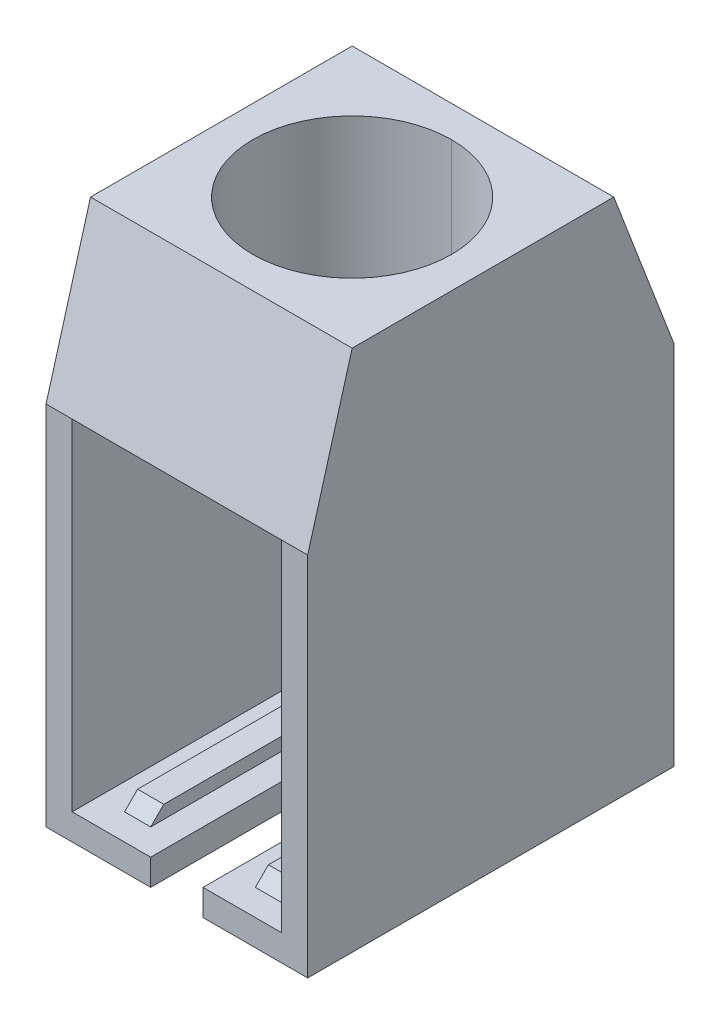
ISO-10303-21;
HEADER;
FILE_DESCRIPTION(('STEP AP214'),'2;1');
FILE_NAME('part.step','',(''),(''),'','','');
FILE_SCHEMA(('AUTOMOTIVE_DESIGN { 1 0 10303 214 1 1 1 1 }'));
ENDSEC;
DATA;
#1=APPLICATION_CONTEXT('core data for automotive mechanical design processes');
#2=APPLICATION_PROTOCOL_DEFINITION('international standard','automotive_design',2000,#1);
#3=PRODUCT_CONTEXT('',#1,'mechanical');
#4=PRODUCT('Part','Part','',(#3));
#5=PRODUCT_RELATED_PRODUCT_CATEGORY('part','',(#4));
#6=PRODUCT_DEFINITION_FORMATION('','',#4);
#7=PRODUCT_DEFINITION_CONTEXT('part definition',#1,'design');
#8=PRODUCT_DEFINITION('design','',#6,#7);
#9=PRODUCT_DEFINITION_SHAPE('','',#8);
#10=(LENGTH_UNIT() NAMED_UNIT(*) SI_UNIT(.MILLI.,.METRE.));
#11=(NAMED_UNIT(*) PLANE_ANGLE_UNIT() SI_UNIT($,.RADIAN.));
#12=(NAMED_UNIT(*) SI_UNIT($,.STERADIAN.) SOLID_ANGLE_UNIT());
#13=UNCERTAINTY_MEASURE_WITH_UNIT(LENGTH_MEASURE(1.E-05),#10,'distance_accuracy_value','');
#14=(GEOMETRIC_REPRESENTATION_CONTEXT(3) GLOBAL_UNCERTAINTY_ASSIGNED_CONTEXT((#13)) GLOBAL_UNIT_ASSIGNED_CONTEXT((#10,
#11,#12)) REPRESENTATION_CONTEXT('',''));
#15=CARTESIAN_POINT('',(0.,0.,0.));
#16=DIRECTION('',(0.,0.,1.));
#17=DIRECTION('',(1.,0.,0.));
#18=AXIS2_PLACEMENT_3D('',#15,#16,#17);
#19=CARTESIAN_POINT('',(-2.,6.5,3.));
#20=DIRECTION('',(0.,0.707106781186548,-0.707106781186547));
#21=DIRECTION('',(-1.,0.,0.));
#22=AXIS2_PLACEMENT_3D('',#19,#20,#21);
#23=PLANE('',#22);
#24=DIRECTION('',(0.,-0.707106781186547,-0.707106781186548));
#25=VECTOR('',#24,1.);
#26=CARTESIAN_POINT('',(2.,-0.355551275463989,-3.85555127546401));
#27=LINE('',#26,#25);
#28=CARTESIAN_POINT('',(2.,7.,3.5));
#29=VERTEX_POINT('',#28);
#30=CARTESIAN_POINT('',(2.,6.5,3.));
#31=VERTEX_POINT('',#30);
#32=EDGE_CURVE('E357',#29,#31,#27,.T.);
#33=ORIENTED_EDGE('',*,*,#32,.F.);
#34=DIRECTION('',(1.,0.,0.));
#35=VECTOR('',#34,1.);
#36=CARTESIAN_POINT('',(-2.5,7.,3.5));
#37=LINE('',#36,#35);
#38=CARTESIAN_POINT('',(-2.,7.,3.5));
#39=VERTEX_POINT('',#38);
#40=EDGE_CURVE('E327',#39,#29,#37,.T.);
#41=ORIENTED_EDGE('',*,*,#40,.F.);
#42=DIRECTION('',(0.,0.707106781186547,0.707106781186548));
#43=VECTOR('',#42,1.);
#44=CARTESIAN_POINT('',(-2.,-0.355551275463989,-3.85555127546401));
#45=LINE('',#44,#43);
#46=CARTESIAN_POINT('',(-2.,6.5,3.));
#47=VERTEX_POINT('',#46);
#48=EDGE_CURVE('E506',#47,#39,#45,.T.);
#49=ORIENTED_EDGE('',*,*,#48,.F.);
#50=DIRECTION('',(-1.,0.,0.));
#51=VECTOR('',#50,1.);
#52=CARTESIAN_POINT('',(-2.,6.5,3.));
#53=LINE('',#52,#51);
#54=EDGE_CURVE('E509',#31,#47,#53,.T.);
#55=ORIENTED_EDGE('',*,*,#54,.F.);
#56=EDGE_LOOP('',(#33,#41,#49,#55));
#57=FACE_BOUND('',#56,.T.);
#58=ADVANCED_FACE('F17',(#57),#23,.F.);
#59=CARTESIAN_POINT('',(0.,0.75,2.75));
#60=DIRECTION('',(0.,0.707106781186545,0.70710678118655));
#61=DIRECTION('',(1.,0.,0.));
#62=AXIS2_PLACEMENT_3D('',#59,#60,#61);
#63=PLANE('',#62);
#64=DIRECTION('',(0.,0.70710678118655,-0.707106781186545));
#65=VECTOR('',#64,1.);
#66=CARTESIAN_POINT('',(-1.5,0.749999999999976,2.75));
#67=LINE('',#66,#65);
#68=CARTESIAN_POINT('',(-1.5,0.5,3.));
#69=VERTEX_POINT('',#68);
#70=CARTESIAN_POINT('',(-1.5,0.75,2.75));
#71=VERTEX_POINT('',#70);
#72=EDGE_CURVE('E268',#69,#71,#67,.T.);
#73=ORIENTED_EDGE('',*,*,#72,.F.);
#74=DIRECTION('',(1.,0.,0.));
#75=VECTOR('',#74,1.);
#76=CARTESIAN_POINT('',(0.,0.5,3.));
#77=LINE('',#76,#75);
#78=CARTESIAN_POINT('',(-1.,0.5,3.));
#79=VERTEX_POINT('',#78);
#80=EDGE_CURVE('E253',#69,#79,#77,.T.);
#81=ORIENTED_EDGE('',*,*,#80,.T.);
#82=DIRECTION('',(0.,-0.70710678118655,0.707106781186545));
#83=VECTOR('',#82,1.);
#84=CARTESIAN_POINT('',(-1.,2.125,1.375));
#85=LINE('',#84,#83);
#86=CARTESIAN_POINT('',(-1.,0.75,2.75));
#87=VERTEX_POINT('',#86);
#88=EDGE_CURVE('E248',#87,#79,#85,.T.);
#89=ORIENTED_EDGE('',*,*,#88,.F.);
#90=DIRECTION('',(1.,0.,0.));
#91=VECTOR('',#90,1.);
#92=CARTESIAN_POINT('',(-1.,0.75,2.75));
#93=LINE('',#92,#91);
#94=EDGE_CURVE('E236',#71,#87,#93,.T.);
#95=ORIENTED_EDGE('',*,*,#94,.F.);
#96=EDGE_LOOP('',(#73,#81,#89,#95));
#97=FACE_BOUND('',#96,.T.);
#98=ADVANCED_FACE('F251',(#97),#63,.T.);
#99=CARTESIAN_POINT('',(0.,0.75,2.75));
#100=DIRECTION('',(0.,0.707106781186545,0.70710678118655));
#101=DIRECTION('',(1.,0.,0.));
#102=AXIS2_PLACEMENT_3D('',#99,#100,#101);
#103=PLANE('',#102);
#104=DIRECTION('',(0.,0.70710678118655,-0.707106781186545));
#105=VECTOR('',#104,1.);
#106=CARTESIAN_POINT('',(1.,0.75,2.75));
#107=LINE('',#106,#105);
#108=CARTESIAN_POINT('',(1.,0.5,3.));
#109=VERTEX_POINT('',#108);
#110=CARTESIAN_POINT('',(1.,0.75,2.75));
#111=VERTEX_POINT('',#110);
#112=EDGE_CURVE('E279',#109,#111,#107,.T.);
#113=ORIENTED_EDGE('',*,*,#112,.F.);
#114=DIRECTION('',(1.,0.,0.));
#115=VECTOR('',#114,1.);
#116=CARTESIAN_POINT('',(0.,0.5,3.));
#117=LINE('',#116,#115);
#118=CARTESIAN_POINT('',(1.5,0.5,3.));
#119=VERTEX_POINT('',#118);
#120=EDGE_CURVE('E299',#109,#119,#117,.T.);
#121=ORIENTED_EDGE('',*,*,#120,.T.);
#122=DIRECTION('',(0.,-0.70710678118655,0.707106781186545));
#123=VECTOR('',#122,1.);
#124=CARTESIAN_POINT('',(1.5,2.125,1.375));
#125=LINE('',#124,#123);
#126=CARTESIAN_POINT('',(1.5,0.75,2.75));
#127=VERTEX_POINT('',#126);
#128=EDGE_CURVE('E276',#127,#119,#125,.T.);
#129=ORIENTED_EDGE('',*,*,#128,.F.);
#130=DIRECTION('',(1.,0.,0.));
#131=VECTOR('',#130,1.);
#132=CARTESIAN_POINT('',(1.5,0.75,2.75));
#133=LINE('',#132,#131);
#134=EDGE_CURVE('E11',#111,#127,#133,.T.);
#135=ORIENTED_EDGE('',*,*,#134,.F.);
#136=EDGE_LOOP('',(#113,#121,#129,#135));
#137=FACE_BOUND('',#136,.T.);
#138=ADVANCED_FACE('F298',(#137),#103,.T.);
#139=CARTESIAN_POINT('',(0.,0.75,0.));
#140=DIRECTION('',(0.,1.,0.));
#141=DIRECTION('',(1.,0.,0.));
#142=AXIS2_PLACEMENT_3D('',#139,#140,#141);
#143=PLANE('',#142);
#144=DIRECTION('',(0.,0.,1.));
#145=VECTOR('',#144,1.);
#146=CARTESIAN_POINT('',(1.,0.75,0.));
#147=LINE('',#146,#145);
#148=CARTESIAN_POINT('',(1.,0.75,-3.));
#149=VERTEX_POINT('',#148);
#150=EDGE_CURVE('E26',#149,#111,#147,.T.);
#151=ORIENTED_EDGE('',*,*,#150,.T.);
#152=ORIENTED_EDGE('',*,*,#134,.T.);
#153=DIRECTION('',(0.,0.,1.));
#154=VECTOR('',#153,1.);
#155=CARTESIAN_POINT('',(1.5,0.75,0.));
#156=LINE('',#155,#154);
#157=CARTESIAN_POINT('',(1.5,0.75,-3.));
#158=VERTEX_POINT('',#157);
#159=EDGE_CURVE('E247',#158,#127,#156,.T.);
#160=ORIENTED_EDGE('',*,*,#159,.F.);
#161=DIRECTION('',(-1.,0.,0.));
#162=VECTOR('',#161,1.);
#163=CARTESIAN_POINT('',(0.,0.75,-3.));
#164=LINE('',#163,#162);
#165=EDGE_CURVE('E289',#158,#149,#164,.T.);
#166=ORIENTED_EDGE('',*,*,#165,.T.);
#167=EDGE_LOOP('',(#151,#152,#160,#166));
#168=FACE_BOUND('',#167,.T.);
#169=ADVANCED_FACE('F287',(#168),#143,.T.);
#170=CARTESIAN_POINT('',(1.,0.75,0.));
#171=DIRECTION('',(1.,0.,0.));
#172=DIRECTION('',(0.,0.,-1.));
#173=AXIS2_PLACEMENT_3D('',#170,#171,#172);
#174=PLANE('',#173);
#175=DIRECTION('',(0.,0.,1.));
#176=VECTOR('',#175,1.);
#177=CARTESIAN_POINT('',(1.,0.5,0.));
#178=LINE('',#177,#176);
#179=CARTESIAN_POINT('',(1.,0.5,-3.));
#180=VERTEX_POINT('',#179);
#181=EDGE_CURVE('E295',#180,#109,#178,.T.);
#182=ORIENTED_EDGE('',*,*,#181,.T.);
#183=ORIENTED_EDGE('',*,*,#112,.T.);
#184=ORIENTED_EDGE('',*,*,#150,.F.);
#185=DIRECTION('',(0.,-1.,0.));
#186=VECTOR('',#185,1.);
#187=CARTESIAN_POINT('',(1.,0.75,-3.));
#188=LINE('',#187,#186);
#189=EDGE_CURVE('E447',#149,#180,#188,.T.);
#190=ORIENTED_EDGE('',*,*,#189,.T.);
#191=EDGE_LOOP('',(#182,#183,#184,#190));
#192=FACE_BOUND('',#191,.T.);
#193=ADVANCED_FACE('F293',(#192),#174,.F.);
#194=CARTESIAN_POINT('',(1.5,0.75,0.));
#195=DIRECTION('',(1.,0.,0.));
#196=DIRECTION('',(0.,0.,-1.));
#197=AXIS2_PLACEMENT_3D('',#194,#195,#196);
#198=PLANE('',#197);
#199=ORIENTED_EDGE('',*,*,#159,.T.);
#200=ORIENTED_EDGE('',*,*,#128,.T.);
#201=DIRECTION('',(0.,0.,1.));
#202=VECTOR('',#201,1.);
#203=CARTESIAN_POINT('',(1.5,0.5,0.));
#204=LINE('',#203,#202);
#205=CARTESIAN_POINT('',(1.5,0.5,-3.));
#206=VERTEX_POINT('',#205);
#207=EDGE_CURVE('E303',#206,#119,#204,.T.);
#208=ORIENTED_EDGE('',*,*,#207,.F.);
#209=DIRECTION('',(0.,-1.,0.));
#210=VECTOR('',#209,1.);
#211=CARTESIAN_POINT('',(1.5,0.75,-3.));
#212=LINE('',#211,#210);
#213=EDGE_CURVE('E425',#158,#206,#212,.T.);
#214=ORIENTED_EDGE('',*,*,#213,.F.);
#215=EDGE_LOOP('',(#199,#200,#208,#214));
#216=FACE_BOUND('',#215,.T.);
#217=ADVANCED_FACE('F1000',(#216),#198,.T.);
#218=CARTESIAN_POINT('',(0.,0.75,0.));
#219=DIRECTION('',(0.,1.,0.));
#220=DIRECTION('',(1.,0.,0.));
#221=AXIS2_PLACEMENT_3D('',#218,#219,#220);
#222=PLANE('',#221);
#223=DIRECTION('',(0.,0.,1.));
#224=VECTOR('',#223,1.);
#225=CARTESIAN_POINT('',(-1.5,0.75,0.));
#226=LINE('',#225,#224);
#227=CARTESIAN_POINT('',(-1.5,0.75,-3.));
#228=VERTEX_POINT('',#227);
#229=EDGE_CURVE('E243',#228,#71,#226,.T.);
#230=ORIENTED_EDGE('',*,*,#229,.T.);
#231=ORIENTED_EDGE('',*,*,#94,.T.);
#232=DIRECTION('',(0.,0.,1.));
#233=VECTOR('',#232,1.);
#234=CARTESIAN_POINT('',(-1.,0.75,0.));
#235=LINE('',#234,#233);
#236=CARTESIAN_POINT('',(-1.,0.75,-3.));
#237=VERTEX_POINT('',#236);
#238=EDGE_CURVE('E241',#237,#87,#235,.T.);
#239=ORIENTED_EDGE('',*,*,#238,.F.);
#240=DIRECTION('',(-1.,0.,0.));
#241=VECTOR('',#240,1.);
#242=CARTESIAN_POINT('',(0.,0.75,-3.));
#243=LINE('',#242,#241);
#244=EDGE_CURVE('E369',#237,#228,#243,.T.);
#245=ORIENTED_EDGE('',*,*,#244,.T.);
#246=EDGE_LOOP('',(#230,#231,#239,#245));
#247=FACE_BOUND('',#246,.T.);
#248=ADVANCED_FACE('F238',(#247),#222,.T.);
#249=CARTESIAN_POINT('',(-1.,0.75,0.));
#250=DIRECTION('',(1.,0.,0.));
#251=DIRECTION('',(0.,0.,1.));
#252=AXIS2_PLACEMENT_3D('',#249,#250,#251);
#253=PLANE('',#252);
#254=ORIENTED_EDGE('',*,*,#238,.T.);
#255=ORIENTED_EDGE('',*,*,#88,.T.);
#256=DIRECTION('',(0.,0.,1.));
#257=VECTOR('',#256,1.);
#258=CARTESIAN_POINT('',(-1.,0.5,0.));
#259=LINE('',#258,#257);
#260=CARTESIAN_POINT('',(-1.,0.5,-3.));
#261=VERTEX_POINT('',#260);
#262=EDGE_CURVE('E388',#261,#79,#259,.T.);
#263=ORIENTED_EDGE('',*,*,#262,.F.);
#264=DIRECTION('',(0.,-1.,0.));
#265=VECTOR('',#264,1.);
#266=CARTESIAN_POINT('',(-1.,0.75,-3.));
#267=LINE('',#266,#265);
#268=EDGE_CURVE('E260',#237,#261,#267,.T.);
#269=ORIENTED_EDGE('',*,*,#268,.F.);
#270=EDGE_LOOP('',(#254,#255,#263,#269));
#271=FACE_BOUND('',#270,.T.);
#272=ADVANCED_FACE('F259',(#271),#253,.T.);
#273=CARTESIAN_POINT('',(-1.5,0.75,0.));
#274=DIRECTION('',(1.,0.,0.));
#275=DIRECTION('',(0.,0.,-1.));
#276=AXIS2_PLACEMENT_3D('',#273,#274,#275);
#277=PLANE('',#276);
#278=DIRECTION('',(0.,0.,1.));
#279=VECTOR('',#278,1.);
#280=CARTESIAN_POINT('',(-1.5,0.5,0.));
#281=LINE('',#280,#279);
#282=CARTESIAN_POINT('',(-1.5,0.5,-3.));
#283=VERTEX_POINT('',#282);
#284=EDGE_CURVE('E391',#283,#69,#281,.T.);
#285=ORIENTED_EDGE('',*,*,#284,.T.);
#286=ORIENTED_EDGE('',*,*,#72,.T.);
#287=ORIENTED_EDGE('',*,*,#229,.F.);
#288=DIRECTION('',(0.,-1.,0.));
#289=VECTOR('',#288,1.);
#290=CARTESIAN_POINT('',(-1.5,0.75,-3.));
#291=LINE('',#290,#289);
#292=EDGE_CURVE('E372',#228,#283,#291,.T.);
#293=ORIENTED_EDGE('',*,*,#292,.T.);
#294=EDGE_LOOP('',(#285,#286,#287,#293));
#295=FACE_BOUND('',#294,.T.);
#296=ADVANCED_FACE('F523',(#295),#277,.F.);
#297=CARTESIAN_POINT('',(-0.5,10.001,3.5));
#298=DIRECTION('',(-1.,0.,0.));
#299=DIRECTION('',(0.,0.,1.));
#300=AXIS2_PLACEMENT_3D('',#297,#298,#299);
#301=PLANE('',#300);
#302=DIRECTION('',(0.,0.,1.));
#303=VECTOR('',#302,1.);
#304=CARTESIAN_POINT('',(-0.5,0.5,3.5));
#305=LINE('',#304,#303);
#306=CARTESIAN_POINT('',(-0.5,0.5,0.15));
#307=VERTEX_POINT('',#306);
#308=CARTESIAN_POINT('',(-0.5,0.5,3.5));
#309=VERTEX_POINT('',#308);
#310=EDGE_CURVE('E400',#307,#309,#305,.T.);
#311=ORIENTED_EDGE('',*,*,#310,.T.);
#312=DIRECTION('',(0.,-1.,0.));
#313=VECTOR('',#312,1.);
#314=CARTESIAN_POINT('',(-0.5,10.001,3.5));
#315=LINE('',#314,#313);
#316=CARTESIAN_POINT('',(-0.5,0.,3.5));
#317=VERTEX_POINT('',#316);
#318=EDGE_CURVE('E351',#309,#317,#315,.T.);
#319=ORIENTED_EDGE('',*,*,#318,.T.);
#320=DIRECTION('',(0.,0.,-1.));
#321=VECTOR('',#320,1.);
#322=CARTESIAN_POINT('',(-0.5,0.,3.5));
#323=LINE('',#322,#321);
#324=CARTESIAN_POINT('',(-0.5,0.,0.15));
#325=VERTEX_POINT('',#324);
#326=EDGE_CURVE('E323',#317,#325,#323,.T.);
#327=ORIENTED_EDGE('',*,*,#326,.T.);
#328=DIRECTION('',(0.,-1.,0.));
#329=VECTOR('',#328,1.);
#330=CARTESIAN_POINT('',(-0.5,10.001,0.15));
#331=LINE('',#330,#329);
#332=EDGE_CURVE('E514',#307,#325,#331,.T.);
#333=ORIENTED_EDGE('',*,*,#332,.F.);
#334=EDGE_LOOP('',(#311,#319,#327,#333));
#335=FACE_BOUND('',#334,.T.);
#336=ADVANCED_FACE('F1168',(#335),#301,.F.);
#337=CARTESIAN_POINT('',(0.,10.001,0.15));
#338=DIRECTION('',(0.,-1.,0.));
#339=DIRECTION('',(0.,0.,-1.));
#340=AXIS2_PLACEMENT_3D('',#337,#338,#339);
#341=CYLINDRICAL_SURFACE('',#340,0.5);
#342=DIRECTION('',(0.,-1.,0.));
#343=VECTOR('',#342,1.);
#344=CARTESIAN_POINT('',(0.,10.001,-0.35));
#345=LINE('',#344,#343);
#346=CARTESIAN_POINT('',(0.,0.5,-0.35));
#347=VERTEX_POINT('',#346);
#348=CARTESIAN_POINT('',(0.,0.,-0.35));
#349=VERTEX_POINT('',#348);
#350=EDGE_CURVE('E536',#347,#349,#345,.T.);
#351=ORIENTED_EDGE('',*,*,#350,.F.);
#352=CARTESIAN_POINT('',(0.,0.5,0.15));
#353=DIRECTION('',(0.,1.,0.));
#354=DIRECTION('',(0.,0.,-1.));
#355=AXIS2_PLACEMENT_3D('',#352,#353,#354);
#356=CIRCLE('',#355,0.5);
#357=EDGE_CURVE('E403',#347,#307,#356,.T.);
#358=ORIENTED_EDGE('',*,*,#357,.T.);
#359=ORIENTED_EDGE('',*,*,#332,.T.);
#360=CARTESIAN_POINT('',(0.,0.,0.15));
#361=DIRECTION('',(0.,-1.,0.));
#362=DIRECTION('',(0.,0.,-1.));
#363=AXIS2_PLACEMENT_3D('',#360,#361,#362);
#364=CIRCLE('',#363,0.5);
#365=EDGE_CURVE('E328',#325,#349,#364,.T.);
#366=ORIENTED_EDGE('',*,*,#365,.T.);
#367=EDGE_LOOP('',(#351,#358,#359,#366));
#368=FACE_BOUND('',#367,.T.);
#369=ADVANCED_FACE('F1158',(#368),#341,.F.);
#370=CARTESIAN_POINT('',(0.5,10.001,0.15));
#371=DIRECTION('',(1.,0.,0.));
#372=DIRECTION('',(0.,0.,1.));
#373=AXIS2_PLACEMENT_3D('',#370,#371,#372);
#374=PLANE('',#373);
#375=DIRECTION('',(0.,0.,-1.));
#376=VECTOR('',#375,1.);
#377=CARTESIAN_POINT('',(0.5,0.5,0.15));
#378=LINE('',#377,#376);
#379=CARTESIAN_POINT('',(0.5,0.5,3.5));
#380=VERTEX_POINT('',#379);
#381=CARTESIAN_POINT('',(0.5,0.5,0.15));
#382=VERTEX_POINT('',#381);
#383=EDGE_CURVE('E407',#380,#382,#378,.T.);
#384=ORIENTED_EDGE('',*,*,#383,.T.);
#385=DIRECTION('',(0.,-1.,0.));
#386=VECTOR('',#385,1.);
#387=CARTESIAN_POINT('',(0.5,10.001,0.15));
#388=LINE('',#387,#386);
#389=CARTESIAN_POINT('',(0.5,0.,0.15));
#390=VERTEX_POINT('',#389);
#391=EDGE_CURVE('E545',#382,#390,#388,.T.);
#392=ORIENTED_EDGE('',*,*,#391,.T.);
#393=DIRECTION('',(0.,0.,1.));
#394=VECTOR('',#393,1.);
#395=CARTESIAN_POINT('',(0.5,0.,0.15));
#396=LINE('',#395,#394);
#397=CARTESIAN_POINT('',(0.5,0.,3.5));
#398=VERTEX_POINT('',#397);
#399=EDGE_CURVE('E360',#390,#398,#396,.T.);
#400=ORIENTED_EDGE('',*,*,#399,.T.);
#401=DIRECTION('',(0.,-1.,0.));
#402=VECTOR('',#401,1.);
#403=CARTESIAN_POINT('',(0.5,10.001,3.5));
#404=LINE('',#403,#402);
#405=EDGE_CURVE('E416',#380,#398,#404,.T.);
#406=ORIENTED_EDGE('',*,*,#405,.F.);
#407=EDGE_LOOP('',(#384,#392,#400,#406));
#408=FACE_BOUND('',#407,.T.);
#409=ADVANCED_FACE('F566',(#408),#374,.F.);
#410=CARTESIAN_POINT('',(0.,-0.000999999999999265,0.15));
#411=DIRECTION('',(0.,1.,0.));
#412=DIRECTION('',(0.,0.,1.));
#413=AXIS2_PLACEMENT_3D('',#410,#411,#412);
#414=CYLINDRICAL_SURFACE('',#413,1.9);
#415=DIRECTION('',(0.,1.,0.));
#416=VECTOR('',#415,1.);
#417=CARTESIAN_POINT('',(0.,-0.000999999999999265,-1.75));
#418=LINE('',#417,#416);
#419=CARTESIAN_POINT('',(0.,6.5,-1.75));
#420=VERTEX_POINT('',#419);
#421=CARTESIAN_POINT('',(0.,10.,-1.75));
#422=VERTEX_POINT('',#421);
#423=EDGE_CURVE('E322',#420,#422,#418,.T.);
#424=ORIENTED_EDGE('',*,*,#423,.F.);
#425=CARTESIAN_POINT('',(0.,6.5,0.15));
#426=DIRECTION('',(0.,-1.,0.));
#427=DIRECTION('',(0.,0.,1.));
#428=AXIS2_PLACEMENT_3D('',#425,#426,#427);
#429=CIRCLE('',#428,1.9);
#430=CARTESIAN_POINT('',(0.,6.5,2.05));
#431=VERTEX_POINT('',#430);
#432=EDGE_CURVE('E512',#420,#431,#429,.T.);
#433=ORIENTED_EDGE('',*,*,#432,.T.);
#434=DIRECTION('',(0.,1.,0.));
#435=VECTOR('',#434,1.);
#436=CARTESIAN_POINT('',(0.,-0.000999999999999265,2.05));
#437=LINE('',#436,#435);
#438=CARTESIAN_POINT('',(0.,10.,2.05));
#439=VERTEX_POINT('',#438);
#440=EDGE_CURVE('E338',#431,#439,#437,.T.);
#441=ORIENTED_EDGE('',*,*,#440,.T.);
#442=CARTESIAN_POINT('',(0.,10.,0.15));
#443=DIRECTION('',(0.,1.,0.));
#444=DIRECTION('',(0.,0.,1.));
#445=AXIS2_PLACEMENT_3D('',#442,#443,#444);
#446=CIRCLE('',#445,1.9);
#447=EDGE_CURVE('E495',#439,#422,#446,.T.);
#448=ORIENTED_EDGE('',*,*,#447,.T.);
#449=EDGE_LOOP('',(#424,#433,#441,#448));
#450=FACE_BOUND('',#449,.T.);
#451=ADVANCED_FACE('F1057',(#450),#414,.F.);
#452=CARTESIAN_POINT('',(-2.,6.5,-10.711102550928));
#453=DIRECTION('',(0.,1.,0.));
#454=DIRECTION('',(1.,0.,0.));
#455=AXIS2_PLACEMENT_3D('',#452,#453,#454);
#456=PLANE('',#455);
#457=CARTESIAN_POINT('',(0.,6.5,0.15));
#458=DIRECTION('',(0.,-1.,0.));
#459=DIRECTION('',(0.,0.,1.));
#460=AXIS2_PLACEMENT_3D('',#457,#458,#459);
#461=CIRCLE('',#460,1.9);
#462=EDGE_CURVE('E541',#431,#420,#461,.T.);
#463=ORIENTED_EDGE('',*,*,#462,.F.);
#464=ORIENTED_EDGE('',*,*,#432,.F.);
#465=EDGE_LOOP('',(#463,#464));
#466=FACE_BOUND('',#465,.T.);
#467=DIRECTION('',(0.,0.,1.));
#468=VECTOR('',#467,1.);
#469=CARTESIAN_POINT('',(2.,6.5,-10.711102550928));
#470=LINE('',#469,#468);
#471=CARTESIAN_POINT('',(2.,6.5,-3.));
#472=VERTEX_POINT('',#471);
#473=EDGE_CURVE('E352',#472,#31,#470,.T.);
#474=ORIENTED_EDGE('',*,*,#473,.T.);
#475=ORIENTED_EDGE('',*,*,#54,.T.);
#476=DIRECTION('',(0.,0.,1.));
#477=VECTOR('',#476,1.);
#478=CARTESIAN_POINT('',(-2.,6.5,-10.711102550928));
#479=LINE('',#478,#477);
#480=CARTESIAN_POINT('',(-2.,6.5,-3.));
#481=VERTEX_POINT('',#480);
#482=EDGE_CURVE('E356',#481,#47,#479,.T.);
#483=ORIENTED_EDGE('',*,*,#482,.F.);
#484=DIRECTION('',(1.,0.,0.));
#485=VECTOR('',#484,1.);
#486=CARTESIAN_POINT('',(-2.,6.5,-3.));
#487=LINE('',#486,#485);
#488=EDGE_CURVE('E435',#481,#472,#487,.T.);
#489=ORIENTED_EDGE('',*,*,#488,.T.);
#490=EDGE_LOOP('',(#474,#475,#483,#489));
#491=FACE_BOUND('',#490,.T.);
#492=ADVANCED_FACE('F1017',(#466,#491),#456,.F.);
#493=CARTESIAN_POINT('',(-2.,6.5,-10.711102550928));
#494=DIRECTION('',(-1.,0.,0.));
#495=DIRECTION('',(0.,0.,1.));
#496=AXIS2_PLACEMENT_3D('',#493,#494,#495);
#497=PLANE('',#496);
#498=DIRECTION('',(0.,1.,0.));
#499=VECTOR('',#498,1.);
#500=CARTESIAN_POINT('',(-2.,6.5,-3.));
#501=LINE('',#500,#499);
#502=CARTESIAN_POINT('',(-2.,0.5,-3.));
#503=VERTEX_POINT('',#502);
#504=EDGE_CURVE('E439',#503,#481,#501,.T.);
#505=ORIENTED_EDGE('',*,*,#504,.T.);
#506=ORIENTED_EDGE('',*,*,#482,.T.);
#507=ORIENTED_EDGE('',*,*,#48,.T.);
#508=DIRECTION('',(0.,-1.,0.));
#509=VECTOR('',#508,1.);
#510=CARTESIAN_POINT('',(-2.,6.5,3.5));
#511=LINE('',#510,#509);
#512=CARTESIAN_POINT('',(-2.,0.5,3.5));
#513=VERTEX_POINT('',#512);
#514=EDGE_CURVE('E342',#39,#513,#511,.T.);
#515=ORIENTED_EDGE('',*,*,#514,.T.);
#516=DIRECTION('',(0.,0.,1.));
#517=VECTOR('',#516,1.);
#518=CARTESIAN_POINT('',(-2.,0.5,-10.711102550928));
#519=LINE('',#518,#517);
#520=EDGE_CURVE('E398',#503,#513,#519,.T.);
#521=ORIENTED_EDGE('',*,*,#520,.F.);
#522=EDGE_LOOP('',(#505,#506,#507,#515,#521));
#523=FACE_BOUND('',#522,.T.);
#524=ADVANCED_FACE('F1012',(#523),#497,.F.);
#525=CARTESIAN_POINT('',(2.,6.5,-10.711102550928));
#526=DIRECTION('',(1.,0.,0.));
#527=DIRECTION('',(0.,1.,0.));
#528=AXIS2_PLACEMENT_3D('',#525,#526,#527);
#529=PLANE('',#528);
#530=DIRECTION('',(0.,-1.,0.));
#531=VECTOR('',#530,1.);
#532=CARTESIAN_POINT('',(2.,6.5,-3.));
#533=LINE('',#532,#531);
#534=CARTESIAN_POINT('',(2.,0.5,-3.));
#535=VERTEX_POINT('',#534);
#536=EDGE_CURVE('E428',#472,#535,#533,.T.);
#537=ORIENTED_EDGE('',*,*,#536,.T.);
#538=DIRECTION('',(0.,0.,1.));
#539=VECTOR('',#538,1.);
#540=CARTESIAN_POINT('',(2.,0.5,-10.711102550928));
#541=LINE('',#540,#539);
#542=CARTESIAN_POINT('',(2.,0.5,3.5));
#543=VERTEX_POINT('',#542);
#544=EDGE_CURVE('E421',#535,#543,#541,.T.);
#545=ORIENTED_EDGE('',*,*,#544,.T.);
#546=DIRECTION('',(0.,1.,0.));
#547=VECTOR('',#546,1.);
#548=CARTESIAN_POINT('',(2.,6.5,3.5));
#549=LINE('',#548,#547);
#550=EDGE_CURVE('E412',#543,#29,#549,.T.);
#551=ORIENTED_EDGE('',*,*,#550,.T.);
#552=ORIENTED_EDGE('',*,*,#32,.T.);
#553=ORIENTED_EDGE('',*,*,#473,.F.);
#554=EDGE_LOOP('',(#537,#545,#551,#552,#553));
#555=FACE_BOUND('',#554,.T.);
#556=ADVANCED_FACE('F970',(#555),#529,.F.);
#557=CARTESIAN_POINT('',(-2.5,7.,3.5));
#558=DIRECTION('',(0.,-0.272602572456025,-0.962126726315384));
#559=DIRECTION('',(0.,-0.962126726315384,0.272602572456025));
#560=AXIS2_PLACEMENT_3D('',#557,#558,#559);
#561=PLANE('',#560);
#562=DIRECTION('',(0.,0.962126726315384,-0.272602572456025));
#563=VECTOR('',#562,1.);
#564=CARTESIAN_POINT('',(2.5,7.,3.5));
#565=LINE('',#564,#563);
#566=CARTESIAN_POINT('',(2.5,7.,3.5));
#567=VERTEX_POINT('',#566);
#568=CARTESIAN_POINT('',(2.5,10.,2.65));
#569=VERTEX_POINT('',#568);
#570=EDGE_CURVE('E380',#567,#569,#565,.T.);
#571=ORIENTED_EDGE('',*,*,#570,.T.);
#572=DIRECTION('',(1.,0.,0.));
#573=VECTOR('',#572,1.);
#574=CARTESIAN_POINT('',(-2.5,10.,2.65));
#575=LINE('',#574,#573);
#576=CARTESIAN_POINT('',(-2.5,10.,2.65));
#577=VERTEX_POINT('',#576);
#578=EDGE_CURVE('E329',#577,#569,#575,.T.);
#579=ORIENTED_EDGE('',*,*,#578,.F.);
#580=DIRECTION('',(0.,0.962126726315384,-0.272602572456025));
#581=VECTOR('',#580,1.);
#582=CARTESIAN_POINT('',(-2.5,7.,3.5));
#583=LINE('',#582,#581);
#584=CARTESIAN_POINT('',(-2.5,7.,3.5));
#585=VERTEX_POINT('',#584);
#586=EDGE_CURVE('E455',#585,#577,#583,.T.);
#587=ORIENTED_EDGE('',*,*,#586,.F.);
#588=DIRECTION('',(1.,0.,0.));
#589=VECTOR('',#588,1.);
#590=CARTESIAN_POINT('',(-2.5,7.,3.5));
#591=LINE('',#590,#589);
#592=EDGE_CURVE('E343',#585,#39,#591,.T.);
#593=ORIENTED_EDGE('',*,*,#592,.T.);
#594=ORIENTED_EDGE('',*,*,#40,.T.);
#595=DIRECTION('',(1.,0.,0.));
#596=VECTOR('',#595,1.);
#597=CARTESIAN_POINT('',(-2.5,7.,3.5));
#598=LINE('',#597,#596);
#599=EDGE_CURVE('E417',#29,#567,#598,.T.);
#600=ORIENTED_EDGE('',*,*,#599,.T.);
#601=EDGE_LOOP('',(#571,#579,#587,#593,#594,#600));
#602=FACE_BOUND('',#601,.T.);
#603=ADVANCED_FACE('F964',(#602),#561,.F.);
#604=CARTESIAN_POINT('',(-2.5,7.,-3.5));
#605=DIRECTION('',(0.,-0.357936011632452,0.93374611730205));
#606=DIRECTION('',(-1.,0.,0.));
#607=AXIS2_PLACEMENT_3D('',#604,#605,#606);
#608=PLANE('',#607);
#609=DIRECTION('',(0.,-0.93374611730205,-0.357936011632452));
#610=VECTOR('',#609,1.);
#611=CARTESIAN_POINT('',(2.5,7.,-3.5));
#612=LINE('',#611,#610);
#613=CARTESIAN_POINT('',(2.5,10.,-2.35));
#614=VERTEX_POINT('',#613);
#615=CARTESIAN_POINT('',(2.5,7.,-3.5));
#616=VERTEX_POINT('',#615);
#617=EDGE_CURVE('E368',#614,#616,#612,.T.);
#618=ORIENTED_EDGE('',*,*,#617,.T.);
#619=DIRECTION('',(1.,0.,0.));
#620=VECTOR('',#619,1.);
#621=CARTESIAN_POINT('',(-2.5,7.,-3.5));
#622=LINE('',#621,#620);
#623=CARTESIAN_POINT('',(-2.5,7.,-3.5));
#624=VERTEX_POINT('',#623);
#625=EDGE_CURVE('E365',#624,#616,#622,.T.);
#626=ORIENTED_EDGE('',*,*,#625,.F.);
#627=DIRECTION('',(0.,-0.93374611730205,-0.357936011632452));
#628=VECTOR('',#627,1.);
#629=CARTESIAN_POINT('',(-2.5,7.,-3.5));
#630=LINE('',#629,#628);
#631=CARTESIAN_POINT('',(-2.5,10.,-2.35));
#632=VERTEX_POINT('',#631);
#633=EDGE_CURVE('E463',#632,#624,#630,.T.);
#634=ORIENTED_EDGE('',*,*,#633,.F.);
#635=DIRECTION('',(1.,0.,0.));
#636=VECTOR('',#635,1.);
#637=CARTESIAN_POINT('',(-2.5,10.,-2.35));
#638=LINE('',#637,#636);
#639=EDGE_CURVE('E332',#632,#614,#638,.T.);
#640=ORIENTED_EDGE('',*,*,#639,.T.);
#641=EDGE_LOOP('',(#618,#626,#634,#640));
#642=FACE_BOUND('',#641,.T.);
#643=ADVANCED_FACE('F969',(#642),#608,.F.);
#644=CARTESIAN_POINT('',(0.,0.,0.));
#645=DIRECTION('',(0.,-1.,0.));
#646=DIRECTION('',(0.,0.,-1.));
#647=AXIS2_PLACEMENT_3D('',#644,#645,#646);
#648=PLANE('',#647);
#649=ORIENTED_EDGE('',*,*,#399,.F.);
#650=CARTESIAN_POINT('',(0.,0.,0.15));
#651=DIRECTION('',(0.,-1.,0.));
#652=DIRECTION('',(0.,0.,-1.));
#653=AXIS2_PLACEMENT_3D('',#650,#651,#652);
#654=CIRCLE('',#653,0.5);
#655=EDGE_CURVE('E540',#349,#390,#654,.T.);
#656=ORIENTED_EDGE('',*,*,#655,.F.);
#657=ORIENTED_EDGE('',*,*,#365,.F.);
#658=ORIENTED_EDGE('',*,*,#326,.F.);
#659=DIRECTION('',(1.,0.,0.));
#660=VECTOR('',#659,1.);
#661=CARTESIAN_POINT('',(2.5,0.,3.5));
#662=LINE('',#661,#660);
#663=CARTESIAN_POINT('',(-2.5,0.,3.5));
#664=VERTEX_POINT('',#663);
#665=EDGE_CURVE('E364',#664,#317,#662,.T.);
#666=ORIENTED_EDGE('',*,*,#665,.F.);
#667=DIRECTION('',(0.,0.,1.));
#668=VECTOR('',#667,1.);
#669=CARTESIAN_POINT('',(-2.5,0.,-3.5));
#670=LINE('',#669,#668);
#671=CARTESIAN_POINT('',(-2.5,0.,-3.5));
#672=VERTEX_POINT('',#671);
#673=EDGE_CURVE('E471',#672,#664,#670,.T.);
#674=ORIENTED_EDGE('',*,*,#673,.F.);
#675=DIRECTION('',(-1.,0.,0.));
#676=VECTOR('',#675,1.);
#677=CARTESIAN_POINT('',(2.5,0.,-3.5));
#678=LINE('',#677,#676);
#679=CARTESIAN_POINT('',(2.5,0.,-3.5));
#680=VERTEX_POINT('',#679);
#681=EDGE_CURVE('E333',#680,#672,#678,.T.);
#682=ORIENTED_EDGE('',*,*,#681,.F.);
#683=DIRECTION('',(0.,0.,-1.));
#684=VECTOR('',#683,1.);
#685=CARTESIAN_POINT('',(2.5,0.,-3.5));
#686=LINE('',#685,#684);
#687=CARTESIAN_POINT('',(2.5,0.,3.5));
#688=VERTEX_POINT('',#687);
#689=EDGE_CURVE('E483',#688,#680,#686,.T.);
#690=ORIENTED_EDGE('',*,*,#689,.F.);
#691=DIRECTION('',(1.,0.,0.));
#692=VECTOR('',#691,1.);
#693=CARTESIAN_POINT('',(2.5,0.,3.5));
#694=LINE('',#693,#692);
#695=EDGE_CURVE('E432',#398,#688,#694,.T.);
#696=ORIENTED_EDGE('',*,*,#695,.F.);
#697=EDGE_LOOP('',(#649,#656,#657,#658,#666,#674,#682,#690,#696));
#698=FACE_BOUND('',#697,.T.);
#699=ADVANCED_FACE('F578',(#698),#648,.T.);
#700=CARTESIAN_POINT('',(0.,10.,0.));
#701=DIRECTION('',(0.,-1.,0.));
#702=DIRECTION('',(0.,0.,-1.));
#703=AXIS2_PLACEMENT_3D('',#700,#701,#702);
#704=PLANE('',#703);
#705=ORIENTED_EDGE('',*,*,#447,.F.);
#706=CARTESIAN_POINT('',(0.,10.,0.15));
#707=DIRECTION('',(0.,1.,0.));
#708=DIRECTION('',(0.,0.,1.));
#709=AXIS2_PLACEMENT_3D('',#706,#707,#708);
#710=CIRCLE('',#709,1.9);
#711=EDGE_CURVE('E334',#422,#439,#710,.T.);
#712=ORIENTED_EDGE('',*,*,#711,.F.);
#713=EDGE_LOOP('',(#705,#712));
#714=FACE_BOUND('',#713,.T.);
#715=DIRECTION('',(0.,0.,1.));
#716=VECTOR('',#715,1.);
#717=CARTESIAN_POINT('',(-2.5,10.,-3.5));
#718=LINE('',#717,#716);
#719=EDGE_CURVE('E459',#632,#577,#718,.T.);
#720=ORIENTED_EDGE('',*,*,#719,.T.);
#721=ORIENTED_EDGE('',*,*,#578,.T.);
#722=DIRECTION('',(0.,0.,-1.));
#723=VECTOR('',#722,1.);
#724=CARTESIAN_POINT('',(2.5,10.,-3.5));
#725=LINE('',#724,#723);
#726=EDGE_CURVE('E376',#569,#614,#725,.T.);
#727=ORIENTED_EDGE('',*,*,#726,.T.);
#728=ORIENTED_EDGE('',*,*,#639,.F.);
#729=EDGE_LOOP('',(#720,#721,#727,#728));
#730=FACE_BOUND('',#729,.T.);
#731=ADVANCED_FACE('F1102',(#714,#730),#704,.F.);
#732=CARTESIAN_POINT('',(2.5,10.,-3.5));
#733=DIRECTION('',(0.,0.,1.));
#734=DIRECTION('',(1.,0.,0.));
#735=AXIS2_PLACEMENT_3D('',#732,#733,#734);
#736=PLANE('',#735);
#737=DIRECTION('',(0.,-1.,0.));
#738=VECTOR('',#737,1.);
#739=CARTESIAN_POINT('',(-2.5,10.,-3.5));
#740=LINE('',#739,#738);
#741=EDGE_CURVE('E467',#624,#672,#740,.T.);
#742=ORIENTED_EDGE('',*,*,#741,.F.);
#743=ORIENTED_EDGE('',*,*,#625,.T.);
#744=DIRECTION('',(0.,-1.,0.));
#745=VECTOR('',#744,1.);
#746=CARTESIAN_POINT('',(2.5,10.,-3.5));
#747=LINE('',#746,#745);
#748=EDGE_CURVE('E487',#616,#680,#747,.T.);
#749=ORIENTED_EDGE('',*,*,#748,.T.);
#750=ORIENTED_EDGE('',*,*,#681,.T.);
#751=EDGE_LOOP('',(#742,#743,#749,#750));
#752=FACE_BOUND('',#751,.T.);
#753=ADVANCED_FACE('F1096',(#752),#736,.F.);
#754=CARTESIAN_POINT('',(2.5,10.,-3.5));
#755=DIRECTION('',(-1.,0.,0.));
#756=DIRECTION('',(0.,1.,0.));
#757=AXIS2_PLACEMENT_3D('',#754,#755,#756);
#758=PLANE('',#757);
#759=ORIENTED_EDGE('',*,*,#726,.F.);
#760=ORIENTED_EDGE('',*,*,#570,.F.);
#761=DIRECTION('',(0.,-1.,0.));
#762=VECTOR('',#761,1.);
#763=CARTESIAN_POINT('',(2.5,10.,3.5));
#764=LINE('',#763,#762);
#765=EDGE_CURVE('E381',#567,#688,#764,.T.);
#766=ORIENTED_EDGE('',*,*,#765,.T.);
#767=ORIENTED_EDGE('',*,*,#689,.T.);
#768=ORIENTED_EDGE('',*,*,#748,.F.);
#769=ORIENTED_EDGE('',*,*,#617,.F.);
#770=EDGE_LOOP('',(#759,#760,#766,#767,#768,#769));
#771=FACE_BOUND('',#770,.T.);
#772=ADVANCED_FACE('F1101',(#771),#758,.F.);
#773=CARTESIAN_POINT('',(2.5,10.,3.5));
#774=DIRECTION('',(0.,0.,-1.));
#775=DIRECTION('',(-1.,0.,0.));
#776=AXIS2_PLACEMENT_3D('',#773,#774,#775);
#777=PLANE('',#776);
#778=ORIENTED_EDGE('',*,*,#599,.F.);
#779=ORIENTED_EDGE('',*,*,#550,.F.);
#780=DIRECTION('',(1.,0.,0.));
#781=VECTOR('',#780,1.);
#782=CARTESIAN_POINT('',(-2.,0.5,3.5));
#783=LINE('',#782,#781);
#784=EDGE_CURVE('E411',#380,#543,#783,.T.);
#785=ORIENTED_EDGE('',*,*,#784,.F.);
#786=ORIENTED_EDGE('',*,*,#405,.T.);
#787=ORIENTED_EDGE('',*,*,#695,.T.);
#788=ORIENTED_EDGE('',*,*,#765,.F.);
#789=EDGE_LOOP('',(#778,#779,#785,#786,#787,#788));
#790=FACE_BOUND('',#789,.T.);
#791=ADVANCED_FACE('F583',(#790),#777,.F.);
#792=CARTESIAN_POINT('',(-2.5,10.,-3.5));
#793=DIRECTION('',(1.,0.,0.));
#794=DIRECTION('',(0.,0.,-1.));
#795=AXIS2_PLACEMENT_3D('',#792,#793,#794);
#796=PLANE('',#795);
#797=DIRECTION('',(0.,-1.,0.));
#798=VECTOR('',#797,1.);
#799=CARTESIAN_POINT('',(-2.5,10.,3.5));
#800=LINE('',#799,#798);
#801=EDGE_CURVE('E347',#585,#664,#800,.T.);
#802=ORIENTED_EDGE('',*,*,#801,.F.);
#803=ORIENTED_EDGE('',*,*,#586,.T.);
#804=ORIENTED_EDGE('',*,*,#719,.F.);
#805=ORIENTED_EDGE('',*,*,#633,.T.);
#806=ORIENTED_EDGE('',*,*,#741,.T.);
#807=ORIENTED_EDGE('',*,*,#673,.T.);
#808=EDGE_LOOP('',(#802,#803,#804,#805,#806,#807));
#809=FACE_BOUND('',#808,.T.);
#810=ADVANCED_FACE('F1078',(#809),#796,.F.);
#811=CARTESIAN_POINT('',(2.5,10.,-3.));
#812=DIRECTION('',(0.,0.,1.));
#813=DIRECTION('',(1.,0.,0.));
#814=AXIS2_PLACEMENT_3D('',#811,#812,#813);
#815=PLANE('',#814);
#816=ORIENTED_EDGE('',*,*,#213,.T.);
#817=DIRECTION('',(-1.,0.,0.));
#818=VECTOR('',#817,1.);
#819=CARTESIAN_POINT('',(-2.,0.5,-3.));
#820=LINE('',#819,#818);
#821=EDGE_CURVE('E310',#535,#206,#820,.T.);
#822=ORIENTED_EDGE('',*,*,#821,.F.);
#823=ORIENTED_EDGE('',*,*,#536,.F.);
#824=ORIENTED_EDGE('',*,*,#488,.F.);
#825=ORIENTED_EDGE('',*,*,#504,.F.);
#826=DIRECTION('',(-1.,0.,0.));
#827=VECTOR('',#826,1.);
#828=CARTESIAN_POINT('',(-2.,0.5,-3.));
#829=LINE('',#828,#827);
#830=EDGE_CURVE('E395',#283,#503,#829,.T.);
#831=ORIENTED_EDGE('',*,*,#830,.F.);
#832=ORIENTED_EDGE('',*,*,#292,.F.);
#833=ORIENTED_EDGE('',*,*,#244,.F.);
#834=ORIENTED_EDGE('',*,*,#268,.T.);
#835=DIRECTION('',(-1.,0.,0.));
#836=VECTOR('',#835,1.);
#837=CARTESIAN_POINT('',(-2.,0.5,-3.));
#838=LINE('',#837,#836);
#839=EDGE_CURVE('E384',#180,#261,#838,.T.);
#840=ORIENTED_EDGE('',*,*,#839,.F.);
#841=ORIENTED_EDGE('',*,*,#189,.F.);
#842=ORIENTED_EDGE('',*,*,#165,.F.);
#843=EDGE_LOOP('',(#816,#822,#823,#824,#825,#831,#832,#833,#834,#840,#841,#842));
#844=FACE_BOUND('',#843,.T.);
#845=ADVANCED_FACE('F1047',(#844),#815,.T.);
#846=CARTESIAN_POINT('',(-2.,0.5,-10.711102550928));
#847=DIRECTION('',(0.,-1.,0.));
#848=DIRECTION('',(0.,0.,-1.));
#849=AXIS2_PLACEMENT_3D('',#846,#847,#848);
#850=PLANE('',#849);
#851=ORIENTED_EDGE('',*,*,#821,.T.);
#852=ORIENTED_EDGE('',*,*,#207,.T.);
#853=ORIENTED_EDGE('',*,*,#120,.F.);
#854=ORIENTED_EDGE('',*,*,#181,.F.);
#855=ORIENTED_EDGE('',*,*,#839,.T.);
#856=ORIENTED_EDGE('',*,*,#262,.T.);
#857=ORIENTED_EDGE('',*,*,#80,.F.);
#858=ORIENTED_EDGE('',*,*,#284,.F.);
#859=ORIENTED_EDGE('',*,*,#830,.T.);
#860=ORIENTED_EDGE('',*,*,#520,.T.);
#861=DIRECTION('',(1.,0.,0.));
#862=VECTOR('',#861,1.);
#863=CARTESIAN_POINT('',(-2.,0.5,3.5));
#864=LINE('',#863,#862);
#865=EDGE_CURVE('E318',#513,#309,#864,.T.);
#866=ORIENTED_EDGE('',*,*,#865,.T.);
#867=ORIENTED_EDGE('',*,*,#310,.F.);
#868=ORIENTED_EDGE('',*,*,#357,.F.);
#869=CARTESIAN_POINT('',(0.,0.5,0.15));
#870=DIRECTION('',(0.,1.,0.));
#871=DIRECTION('',(0.,0.,-1.));
#872=AXIS2_PLACEMENT_3D('',#869,#870,#871);
#873=CIRCLE('',#872,0.5);
#874=EDGE_CURVE('E534',#382,#347,#873,.T.);
#875=ORIENTED_EDGE('',*,*,#874,.F.);
#876=ORIENTED_EDGE('',*,*,#383,.F.);
#877=ORIENTED_EDGE('',*,*,#784,.T.);
#878=ORIENTED_EDGE('',*,*,#544,.F.);
#879=EDGE_LOOP('',(#851,#852,#853,#854,#855,#856,#857,#858,#859,#860,#866,#867,#868,#875,#876,
#877,#878));
#880=FACE_BOUND('',#879,.T.);
#881=ADVANCED_FACE('F307',(#880),#850,.F.);
#882=CARTESIAN_POINT('',(2.5,10.,3.5));
#883=DIRECTION('',(0.,0.,-1.));
#884=DIRECTION('',(-1.,0.,0.));
#885=AXIS2_PLACEMENT_3D('',#882,#883,#884);
#886=PLANE('',#885);
#887=ORIENTED_EDGE('',*,*,#514,.F.);
#888=ORIENTED_EDGE('',*,*,#592,.F.);
#889=ORIENTED_EDGE('',*,*,#801,.T.);
#890=ORIENTED_EDGE('',*,*,#665,.T.);
#891=ORIENTED_EDGE('',*,*,#318,.F.);
#892=ORIENTED_EDGE('',*,*,#865,.F.);
#893=EDGE_LOOP('',(#887,#888,#889,#890,#891,#892));
#894=FACE_BOUND('',#893,.T.);
#895=ADVANCED_FACE('F992',(#894),#886,.F.);
#896=CARTESIAN_POINT('',(0.,-0.000999999999999265,0.15));
#897=DIRECTION('',(0.,1.,0.));
#898=DIRECTION('',(0.,0.,1.));
#899=AXIS2_PLACEMENT_3D('',#896,#897,#898);
#900=CYLINDRICAL_SURFACE('',#899,1.9);
#901=ORIENTED_EDGE('',*,*,#462,.T.);
#902=ORIENTED_EDGE('',*,*,#423,.T.);
#903=ORIENTED_EDGE('',*,*,#711,.T.);
#904=ORIENTED_EDGE('',*,*,#440,.F.);
#905=EDGE_LOOP('',(#901,#902,#903,#904));
#906=FACE_BOUND('',#905,.T.);
#907=ADVANCED_FACE('F982',(#906),#900,.F.);
#908=CARTESIAN_POINT('',(0.,10.001,0.15));
#909=DIRECTION('',(0.,-1.,0.));
#910=DIRECTION('',(0.,0.,-1.));
#911=AXIS2_PLACEMENT_3D('',#908,#909,#910);
#912=CYLINDRICAL_SURFACE('',#911,0.5);
#913=ORIENTED_EDGE('',*,*,#874,.T.);
#914=ORIENTED_EDGE('',*,*,#350,.T.);
#915=ORIENTED_EDGE('',*,*,#655,.T.);
#916=ORIENTED_EDGE('',*,*,#391,.F.);
#917=EDGE_LOOP('',(#913,#914,#915,#916));
#918=FACE_BOUND('',#917,.T.);
#919=ADVANCED_FACE('F574',(#918),#912,.F.);
#920=CLOSED_SHELL('',(#58,#98,#138,#169,#193,#217,#248,#272,#296,#336,#369,#409,#451,#492,#524,
#556,#603,#643,#699,#731,#753,#772,#791,#810,#845,#881,#895,#907,#919));
#921=MANIFOLD_SOLID_BREP('B1',#920);
#922=ADVANCED_BREP_SHAPE_REPRESENTATION('',(#18,#921),#14);
#923=SHAPE_DEFINITION_REPRESENTATION(#9,#922);
ENDSEC;
END-ISO-10303-21;
